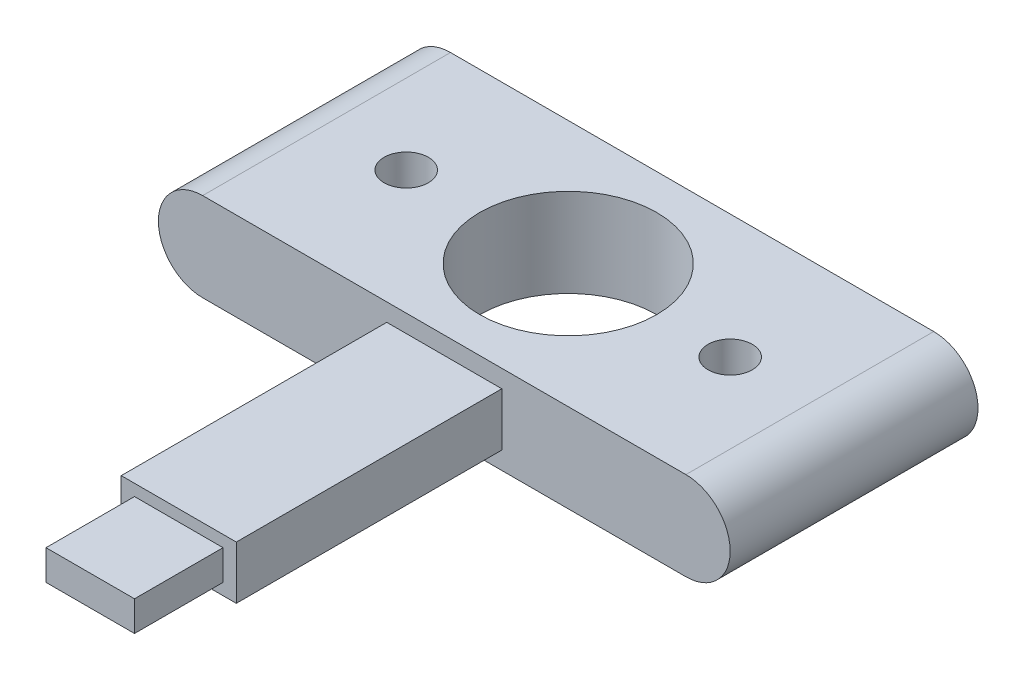
ISO-10303-21;
HEADER;
FILE_DESCRIPTION(('STEP AP214'),'2;1');
FILE_NAME('part.step','',(''),(''),'','','');
FILE_SCHEMA(('AUTOMOTIVE_DESIGN { 1 0 10303 214 1 1 1 1 }'));
ENDSEC;
DATA;
#1=APPLICATION_CONTEXT('core data for automotive mechanical design processes');
#2=APPLICATION_PROTOCOL_DEFINITION('international standard','automotive_design',2000,#1);
#3=PRODUCT_CONTEXT('',#1,'mechanical');
#4=PRODUCT('Part','Part','',(#3));
#5=PRODUCT_RELATED_PRODUCT_CATEGORY('part','',(#4));
#6=PRODUCT_DEFINITION_FORMATION('','',#4);
#7=PRODUCT_DEFINITION_CONTEXT('part definition',#1,'design');
#8=PRODUCT_DEFINITION('design','',#6,#7);
#9=PRODUCT_DEFINITION_SHAPE('','',#8);
#10=(LENGTH_UNIT() NAMED_UNIT(*) SI_UNIT(.MILLI.,.METRE.));
#11=(NAMED_UNIT(*) PLANE_ANGLE_UNIT() SI_UNIT($,.RADIAN.));
#12=(NAMED_UNIT(*) SI_UNIT($,.STERADIAN.) SOLID_ANGLE_UNIT());
#13=UNCERTAINTY_MEASURE_WITH_UNIT(LENGTH_MEASURE(1.E-05),#10,'distance_accuracy_value','');
#14=(GEOMETRIC_REPRESENTATION_CONTEXT(3) GLOBAL_UNCERTAINTY_ASSIGNED_CONTEXT((#13)) GLOBAL_UNIT_ASSIGNED_CONTEXT((#10,
#11,#12)) REPRESENTATION_CONTEXT('',''));
#15=CARTESIAN_POINT('',(0.,0.,0.));
#16=DIRECTION('',(0.,0.,1.));
#17=DIRECTION('',(1.,0.,0.));
#18=AXIS2_PLACEMENT_3D('',#15,#16,#17);
#19=CARTESIAN_POINT('',(32.766,-41.5233681196504,73.66));
#20=DIRECTION('',(0.,0.,1.));
#21=DIRECTION('',(1.,0.,0.));
#22=AXIS2_PLACEMENT_3D('',#19,#20,#21);
#23=PLANE('',#22);
#24=DIRECTION('',(-1.,0.,0.));
#25=VECTOR('',#24,1.);
#26=CARTESIAN_POINT('',(32.766,2.54,73.66));
#27=LINE('',#26,#25);
#28=CARTESIAN_POINT('',(49.276,2.54,73.66));
#29=VERTEX_POINT('',#28);
#30=CARTESIAN_POINT('',(32.766,2.54,73.66));
#31=VERTEX_POINT('',#30);
#32=EDGE_CURVE('E13',#29,#31,#27,.T.);
#33=ORIENTED_EDGE('',*,*,#32,.F.);
#34=DIRECTION('',(0.,1.,0.));
#35=VECTOR('',#34,1.);
#36=CARTESIAN_POINT('',(49.276,-41.5233681196504,73.66));
#37=LINE('',#36,#35);
#38=CARTESIAN_POINT('',(49.276,10.16,73.66));
#39=VERTEX_POINT('',#38);
#40=EDGE_CURVE('E185',#29,#39,#37,.T.);
#41=ORIENTED_EDGE('',*,*,#40,.T.);
#42=DIRECTION('',(1.,0.,0.));
#43=VECTOR('',#42,1.);
#44=CARTESIAN_POINT('',(32.766,10.16,73.66));
#45=LINE('',#44,#43);
#46=CARTESIAN_POINT('',(32.766,10.16,73.66));
#47=VERTEX_POINT('',#46);
#48=EDGE_CURVE('E56',#47,#39,#45,.T.);
#49=ORIENTED_EDGE('',*,*,#48,.F.);
#50=DIRECTION('',(0.,1.,0.));
#51=VECTOR('',#50,1.);
#52=CARTESIAN_POINT('',(32.766,-41.5233681196504,73.66));
#53=LINE('',#52,#51);
#54=EDGE_CURVE('E180',#31,#47,#53,.T.);
#55=ORIENTED_EDGE('',*,*,#54,.F.);
#56=EDGE_LOOP('',(#33,#41,#49,#55));
#57=FACE_BOUND('',#56,.T.);
#58=DIRECTION('',(-1.,0.,0.));
#59=VECTOR('',#58,1.);
#60=CARTESIAN_POINT('',(34.671,8.509,73.66));
#61=LINE('',#60,#59);
#62=CARTESIAN_POINT('',(47.371,8.509,73.66));
#63=VERTEX_POINT('',#62);
#64=CARTESIAN_POINT('',(34.671,8.509,73.66));
#65=VERTEX_POINT('',#64);
#66=EDGE_CURVE('E471',#63,#65,#61,.T.);
#67=ORIENTED_EDGE('',*,*,#66,.F.);
#68=DIRECTION('',(0.,1.,0.));
#69=VECTOR('',#68,1.);
#70=CARTESIAN_POINT('',(47.371,4.191,73.66));
#71=LINE('',#70,#69);
#72=CARTESIAN_POINT('',(47.371,4.191,73.66));
#73=VERTEX_POINT('',#72);
#74=EDGE_CURVE('E160',#73,#63,#71,.T.);
#75=ORIENTED_EDGE('',*,*,#74,.F.);
#76=DIRECTION('',(1.,0.,0.));
#77=VECTOR('',#76,1.);
#78=CARTESIAN_POINT('',(34.671,4.191,73.66));
#79=LINE('',#78,#77);
#80=CARTESIAN_POINT('',(34.671,4.191,73.66));
#81=VERTEX_POINT('',#80);
#82=EDGE_CURVE('E156',#81,#73,#79,.T.);
#83=ORIENTED_EDGE('',*,*,#82,.F.);
#84=DIRECTION('',(0.,-1.,0.));
#85=VECTOR('',#84,1.);
#86=CARTESIAN_POINT('',(34.671,4.191,73.66));
#87=LINE('',#86,#85);
#88=EDGE_CURVE('E473',#65,#81,#87,.T.);
#89=ORIENTED_EDGE('',*,*,#88,.F.);
#90=EDGE_LOOP('',(#67,#75,#83,#89));
#91=FACE_BOUND('',#90,.T.);
#92=ADVANCED_FACE('F46',(#57,#91),#23,.T.);
#93=CARTESIAN_POINT('',(0.,12.7,35.56));
#94=DIRECTION('',(0.,1.,0.));
#95=DIRECTION('',(0.,0.,1.));
#96=AXIS2_PLACEMENT_3D('',#93,#94,#95);
#97=PLANE('',#96);
#98=CARTESIAN_POINT('',(17.78,12.7,17.78));
#99=DIRECTION('',(0.,1.,0.));
#100=DIRECTION('',(0.,0.,-1.));
#101=AXIS2_PLACEMENT_3D('',#98,#99,#100);
#102=CIRCLE('',#101,3.175);
#103=CARTESIAN_POINT('',(17.78,12.7,14.605));
#104=VERTEX_POINT('',#103);
#105=EDGE_CURVE('E452',#104,#104,#102,.T.);
#106=ORIENTED_EDGE('',*,*,#105,.F.);
#107=EDGE_LOOP('',(#106));
#108=FACE_BOUND('',#107,.T.);
#109=CARTESIAN_POINT('',(64.262,12.7,17.78));
#110=DIRECTION('',(0.,1.,0.));
#111=DIRECTION('',(0.,0.,1.));
#112=AXIS2_PLACEMENT_3D('',#109,#110,#111);
#113=CIRCLE('',#112,3.175);
#114=CARTESIAN_POINT('',(64.262,12.7,20.955));
#115=VERTEX_POINT('',#114);
#116=EDGE_CURVE('E451',#115,#115,#113,.T.);
#117=ORIENTED_EDGE('',*,*,#116,.F.);
#118=EDGE_LOOP('',(#117));
#119=FACE_BOUND('',#118,.T.);
#120=CARTESIAN_POINT('',(41.021,12.7,17.78));
#121=DIRECTION('',(0.,1.,0.));
#122=DIRECTION('',(0.,0.,1.));
#123=AXIS2_PLACEMENT_3D('',#120,#121,#122);
#124=CIRCLE('',#123,12.7);
#125=CARTESIAN_POINT('',(41.021,12.7,30.48));
#126=VERTEX_POINT('',#125);
#127=EDGE_CURVE('E461',#126,#126,#124,.T.);
#128=ORIENTED_EDGE('',*,*,#127,.F.);
#129=EDGE_LOOP('',(#128));
#130=FACE_BOUND('',#129,.T.);
#131=DIRECTION('',(1.,0.,0.));
#132=VECTOR('',#131,1.);
#133=CARTESIAN_POINT('',(0.,12.7,35.56));
#134=LINE('',#133,#132);
#135=CARTESIAN_POINT('',(6.34999999999999,12.7,35.56));
#136=VERTEX_POINT('',#135);
#137=CARTESIAN_POINT('',(75.692,12.7,35.56));
#138=VERTEX_POINT('',#137);
#139=EDGE_CURVE('E198',#136,#138,#134,.T.);
#140=ORIENTED_EDGE('',*,*,#139,.T.);
#141=DIRECTION('',(0.,0.,-1.));
#142=VECTOR('',#141,1.);
#143=CARTESIAN_POINT('',(75.692,12.7,35.56));
#144=LINE('',#143,#142);
#145=CARTESIAN_POINT('',(75.692,12.7,0.));
#146=VERTEX_POINT('',#145);
#147=EDGE_CURVE('E205',#138,#146,#144,.T.);
#148=ORIENTED_EDGE('',*,*,#147,.T.);
#149=DIRECTION('',(1.,0.,0.));
#150=VECTOR('',#149,1.);
#151=CARTESIAN_POINT('',(0.,12.7,0.));
#152=LINE('',#151,#150);
#153=CARTESIAN_POINT('',(6.34999999999999,12.7,0.));
#154=VERTEX_POINT('',#153);
#155=EDGE_CURVE('E206',#154,#146,#152,.T.);
#156=ORIENTED_EDGE('',*,*,#155,.F.);
#157=DIRECTION('',(0.,0.,-1.));
#158=VECTOR('',#157,1.);
#159=CARTESIAN_POINT('',(6.34999999999999,12.7,35.56));
#160=LINE('',#159,#158);
#161=EDGE_CURVE('E191',#136,#154,#160,.T.);
#162=ORIENTED_EDGE('',*,*,#161,.F.);
#163=EDGE_LOOP('',(#140,#148,#156,#162));
#164=FACE_BOUND('',#163,.T.);
#165=ADVANCED_FACE('F48',(#108,#119,#130,#164),#97,.T.);
#166=CARTESIAN_POINT('',(6.34999999999999,6.35,35.56));
#167=DIRECTION('',(0.,0.,-1.));
#168=DIRECTION('',(-1.,0.,0.));
#169=AXIS2_PLACEMENT_3D('',#166,#167,#168);
#170=CYLINDRICAL_SURFACE('',#169,6.35);
#171=CARTESIAN_POINT('',(6.34999999999999,6.35,0.));
#172=DIRECTION('',(0.,0.,1.));
#173=DIRECTION('',(1.,0.,0.));
#174=AXIS2_PLACEMENT_3D('',#171,#172,#173);
#175=CIRCLE('',#174,6.35);
#176=CARTESIAN_POINT('',(6.34999999999999,0.,0.));
#177=VERTEX_POINT('',#176);
#178=EDGE_CURVE('E209',#154,#177,#175,.T.);
#179=ORIENTED_EDGE('',*,*,#178,.T.);
#180=DIRECTION('',(0.,0.,-1.));
#181=VECTOR('',#180,1.);
#182=CARTESIAN_POINT('',(6.34999999999999,0.,35.56));
#183=LINE('',#182,#181);
#184=CARTESIAN_POINT('',(6.34999999999999,0.,35.56));
#185=VERTEX_POINT('',#184);
#186=EDGE_CURVE('E220',#185,#177,#183,.T.);
#187=ORIENTED_EDGE('',*,*,#186,.F.);
#188=CARTESIAN_POINT('',(6.34999999999999,6.35,35.56));
#189=DIRECTION('',(0.,0.,1.));
#190=DIRECTION('',(1.,0.,0.));
#191=AXIS2_PLACEMENT_3D('',#188,#189,#190);
#192=CIRCLE('',#191,6.35);
#193=EDGE_CURVE('E197',#136,#185,#192,.T.);
#194=ORIENTED_EDGE('',*,*,#193,.F.);
#195=ORIENTED_EDGE('',*,*,#161,.T.);
#196=EDGE_LOOP('',(#179,#187,#194,#195));
#197=FACE_BOUND('',#196,.T.);
#198=ADVANCED_FACE('F225',(#197),#170,.T.);
#199=CARTESIAN_POINT('',(0.,0.,35.56));
#200=DIRECTION('',(0.,1.,0.));
#201=DIRECTION('',(0.,0.,1.));
#202=AXIS2_PLACEMENT_3D('',#199,#200,#201);
#203=PLANE('',#202);
#204=CARTESIAN_POINT('',(41.021,0.,17.78));
#205=DIRECTION('',(0.,1.,0.));
#206=DIRECTION('',(0.,0.,1.));
#207=AXIS2_PLACEMENT_3D('',#204,#205,#206);
#208=CIRCLE('',#207,12.7);
#209=CARTESIAN_POINT('',(41.021,0.,30.48));
#210=VERTEX_POINT('',#209);
#211=EDGE_CURVE('E463',#210,#210,#208,.T.);
#212=ORIENTED_EDGE('',*,*,#211,.T.);
#213=EDGE_LOOP('',(#212));
#214=FACE_BOUND('',#213,.T.);
#215=DIRECTION('',(0.,0.,-1.));
#216=VECTOR('',#215,1.);
#217=CARTESIAN_POINT('',(75.692,0.,35.56));
#218=LINE('',#217,#216);
#219=CARTESIAN_POINT('',(75.692,0.,35.56));
#220=VERTEX_POINT('',#219);
#221=CARTESIAN_POINT('',(75.692,0.,0.));
#222=VERTEX_POINT('',#221);
#223=EDGE_CURVE('E218',#220,#222,#218,.T.);
#224=ORIENTED_EDGE('',*,*,#223,.F.);
#225=DIRECTION('',(1.,0.,0.));
#226=VECTOR('',#225,1.);
#227=CARTESIAN_POINT('',(0.,0.,35.56));
#228=LINE('',#227,#226);
#229=EDGE_CURVE('E192',#185,#220,#228,.T.);
#230=ORIENTED_EDGE('',*,*,#229,.F.);
#231=ORIENTED_EDGE('',*,*,#186,.T.);
#232=DIRECTION('',(1.,0.,0.));
#233=VECTOR('',#232,1.);
#234=CARTESIAN_POINT('',(0.,0.,0.));
#235=LINE('',#234,#233);
#236=EDGE_CURVE('E211',#177,#222,#235,.T.);
#237=ORIENTED_EDGE('',*,*,#236,.T.);
#238=EDGE_LOOP('',(#224,#230,#231,#237));
#239=FACE_BOUND('',#238,.T.);
#240=ADVANCED_FACE('F243',(#214,#239),#203,.F.);
#241=CARTESIAN_POINT('',(75.692,6.35,35.56));
#242=DIRECTION('',(0.,0.,-1.));
#243=DIRECTION('',(-1.,0.,0.));
#244=AXIS2_PLACEMENT_3D('',#241,#242,#243);
#245=CYLINDRICAL_SURFACE('',#244,6.35);
#246=CARTESIAN_POINT('',(75.692,6.35,0.));
#247=DIRECTION('',(0.,0.,1.));
#248=DIRECTION('',(1.,0.,0.));
#249=AXIS2_PLACEMENT_3D('',#246,#247,#248);
#250=CIRCLE('',#249,6.35);
#251=EDGE_CURVE('E214',#146,#222,#250,.F.);
#252=ORIENTED_EDGE('',*,*,#251,.F.);
#253=ORIENTED_EDGE('',*,*,#147,.F.);
#254=CARTESIAN_POINT('',(75.692,6.35,35.56));
#255=DIRECTION('',(0.,0.,1.));
#256=DIRECTION('',(1.,0.,0.));
#257=AXIS2_PLACEMENT_3D('',#254,#255,#256);
#258=CIRCLE('',#257,6.35);
#259=EDGE_CURVE('E196',#138,#220,#258,.F.);
#260=ORIENTED_EDGE('',*,*,#259,.T.);
#261=ORIENTED_EDGE('',*,*,#223,.T.);
#262=EDGE_LOOP('',(#252,#253,#260,#261));
#263=FACE_BOUND('',#262,.T.);
#264=ADVANCED_FACE('F237',(#263),#245,.T.);
#265=CARTESIAN_POINT('',(0.,0.,35.56));
#266=DIRECTION('',(0.,0.,1.));
#267=DIRECTION('',(1.,0.,0.));
#268=AXIS2_PLACEMENT_3D('',#265,#266,#267);
#269=PLANE('',#268);
#270=DIRECTION('',(0.,1.,0.));
#271=VECTOR('',#270,1.);
#272=CARTESIAN_POINT('',(49.276,-41.5233681196504,35.56));
#273=LINE('',#272,#271);
#274=CARTESIAN_POINT('',(49.276,2.54,35.56));
#275=VERTEX_POINT('',#274);
#276=CARTESIAN_POINT('',(49.276,10.16,35.56));
#277=VERTEX_POINT('',#276);
#278=EDGE_CURVE('E187',#275,#277,#273,.T.);
#279=ORIENTED_EDGE('',*,*,#278,.F.);
#280=DIRECTION('',(-1.,0.,0.));
#281=VECTOR('',#280,1.);
#282=CARTESIAN_POINT('',(82.042,2.54,35.56));
#283=LINE('',#282,#281);
#284=CARTESIAN_POINT('',(32.766,2.54,35.56));
#285=VERTEX_POINT('',#284);
#286=EDGE_CURVE('E165',#275,#285,#283,.T.);
#287=ORIENTED_EDGE('',*,*,#286,.T.);
#288=DIRECTION('',(0.,1.,0.));
#289=VECTOR('',#288,1.);
#290=CARTESIAN_POINT('',(32.766,-41.5233681196504,35.56));
#291=LINE('',#290,#289);
#292=CARTESIAN_POINT('',(32.766,10.16,35.56));
#293=VERTEX_POINT('',#292);
#294=EDGE_CURVE('E50',#285,#293,#291,.T.);
#295=ORIENTED_EDGE('',*,*,#294,.T.);
#296=DIRECTION('',(-1.,0.,0.));
#297=VECTOR('',#296,1.);
#298=CARTESIAN_POINT('',(82.042,10.16,35.56));
#299=LINE('',#298,#297);
#300=EDGE_CURVE('E175',#277,#293,#299,.T.);
#301=ORIENTED_EDGE('',*,*,#300,.F.);
#302=EDGE_LOOP('',(#279,#287,#295,#301));
#303=FACE_BOUND('',#302,.T.);
#304=ORIENTED_EDGE('',*,*,#229,.T.);
#305=ORIENTED_EDGE('',*,*,#259,.F.);
#306=ORIENTED_EDGE('',*,*,#139,.F.);
#307=ORIENTED_EDGE('',*,*,#193,.T.);
#308=EDGE_LOOP('',(#304,#305,#306,#307));
#309=FACE_BOUND('',#308,.T.);
#310=ADVANCED_FACE('F239',(#303,#309),#269,.T.);
#311=CARTESIAN_POINT('',(0.,0.,0.));
#312=DIRECTION('',(0.,0.,1.));
#313=DIRECTION('',(1.,0.,0.));
#314=AXIS2_PLACEMENT_3D('',#311,#312,#313);
#315=PLANE('',#314);
#316=ORIENTED_EDGE('',*,*,#155,.T.);
#317=ORIENTED_EDGE('',*,*,#251,.T.);
#318=ORIENTED_EDGE('',*,*,#236,.F.);
#319=ORIENTED_EDGE('',*,*,#178,.F.);
#320=EDGE_LOOP('',(#316,#317,#318,#319));
#321=FACE_BOUND('',#320,.T.);
#322=ADVANCED_FACE('F232',(#321),#315,.F.);
#323=CARTESIAN_POINT('',(32.766,-41.5233681196504,35.56));
#324=DIRECTION('',(-1.,0.,0.));
#325=DIRECTION('',(0.,0.,1.));
#326=AXIS2_PLACEMENT_3D('',#323,#324,#325);
#327=PLANE('',#326);
#328=DIRECTION('',(0.,0.,-1.));
#329=VECTOR('',#328,1.);
#330=CARTESIAN_POINT('',(32.766,2.54,35.56));
#331=LINE('',#330,#329);
#332=EDGE_CURVE('E162',#31,#285,#331,.T.);
#333=ORIENTED_EDGE('',*,*,#332,.F.);
#334=ORIENTED_EDGE('',*,*,#54,.T.);
#335=DIRECTION('',(0.,0.,1.));
#336=VECTOR('',#335,1.);
#337=CARTESIAN_POINT('',(32.766,10.16,35.56));
#338=LINE('',#337,#336);
#339=EDGE_CURVE('E172',#293,#47,#338,.T.);
#340=ORIENTED_EDGE('',*,*,#339,.F.);
#341=ORIENTED_EDGE('',*,*,#294,.F.);
#342=EDGE_LOOP('',(#333,#334,#340,#341));
#343=FACE_BOUND('',#342,.T.);
#344=ADVANCED_FACE('F265',(#343),#327,.T.);
#345=CARTESIAN_POINT('',(49.276,-41.5233681196504,35.56));
#346=DIRECTION('',(1.,0.,0.));
#347=DIRECTION('',(0.,0.,-1.));
#348=AXIS2_PLACEMENT_3D('',#345,#346,#347);
#349=PLANE('',#348);
#350=DIRECTION('',(0.,0.,1.));
#351=VECTOR('',#350,1.);
#352=CARTESIAN_POINT('',(49.276,2.54,35.56));
#353=LINE('',#352,#351);
#354=EDGE_CURVE('E71',#275,#29,#353,.T.);
#355=ORIENTED_EDGE('',*,*,#354,.F.);
#356=ORIENTED_EDGE('',*,*,#278,.T.);
#357=DIRECTION('',(0.,0.,-1.));
#358=VECTOR('',#357,1.);
#359=CARTESIAN_POINT('',(49.276,10.16,35.56));
#360=LINE('',#359,#358);
#361=EDGE_CURVE('E178',#39,#277,#360,.T.);
#362=ORIENTED_EDGE('',*,*,#361,.F.);
#363=ORIENTED_EDGE('',*,*,#40,.F.);
#364=EDGE_LOOP('',(#355,#356,#362,#363));
#365=FACE_BOUND('',#364,.T.);
#366=ADVANCED_FACE('F263',(#365),#349,.T.);
#367=CARTESIAN_POINT('',(82.042,10.16,35.56));
#368=DIRECTION('',(0.,-1.,0.));
#369=DIRECTION('',(0.,0.,-1.));
#370=AXIS2_PLACEMENT_3D('',#367,#368,#369);
#371=PLANE('',#370);
#372=ORIENTED_EDGE('',*,*,#361,.T.);
#373=ORIENTED_EDGE('',*,*,#300,.T.);
#374=ORIENTED_EDGE('',*,*,#339,.T.);
#375=ORIENTED_EDGE('',*,*,#48,.T.);
#376=EDGE_LOOP('',(#372,#373,#374,#375));
#377=FACE_BOUND('',#376,.T.);
#378=ADVANCED_FACE('F289',(#377),#371,.F.);
#379=CARTESIAN_POINT('',(82.042,2.54,35.56));
#380=DIRECTION('',(0.,1.,0.));
#381=DIRECTION('',(0.,0.,1.));
#382=AXIS2_PLACEMENT_3D('',#379,#380,#381);
#383=PLANE('',#382);
#384=ORIENTED_EDGE('',*,*,#354,.T.);
#385=ORIENTED_EDGE('',*,*,#32,.T.);
#386=ORIENTED_EDGE('',*,*,#332,.T.);
#387=ORIENTED_EDGE('',*,*,#286,.F.);
#388=EDGE_LOOP('',(#384,#385,#386,#387));
#389=FACE_BOUND('',#388,.T.);
#390=ADVANCED_FACE('F296',(#389),#383,.F.);
#391=CARTESIAN_POINT('',(47.371,4.191,86.36));
#392=DIRECTION('',(-1.,0.,0.));
#393=DIRECTION('',(0.,0.,1.));
#394=AXIS2_PLACEMENT_3D('',#391,#392,#393);
#395=PLANE('',#394);
#396=ORIENTED_EDGE('',*,*,#74,.T.);
#397=DIRECTION('',(0.,0.,-1.));
#398=VECTOR('',#397,1.);
#399=CARTESIAN_POINT('',(47.371,8.509,86.36));
#400=LINE('',#399,#398);
#401=CARTESIAN_POINT('',(47.371,8.509,86.36));
#402=VERTEX_POINT('',#401);
#403=EDGE_CURVE('E141',#402,#63,#400,.T.);
#404=ORIENTED_EDGE('',*,*,#403,.F.);
#405=DIRECTION('',(0.,1.,0.));
#406=VECTOR('',#405,1.);
#407=CARTESIAN_POINT('',(47.371,4.191,86.36));
#408=LINE('',#407,#406);
#409=CARTESIAN_POINT('',(47.371,4.191,86.36));
#410=VERTEX_POINT('',#409);
#411=EDGE_CURVE('E148',#410,#402,#408,.T.);
#412=ORIENTED_EDGE('',*,*,#411,.F.);
#413=DIRECTION('',(0.,0.,-1.));
#414=VECTOR('',#413,1.);
#415=CARTESIAN_POINT('',(47.371,4.191,86.36));
#416=LINE('',#415,#414);
#417=EDGE_CURVE('E469',#410,#73,#416,.T.);
#418=ORIENTED_EDGE('',*,*,#417,.T.);
#419=EDGE_LOOP('',(#396,#404,#412,#418));
#420=FACE_BOUND('',#419,.T.);
#421=ADVANCED_FACE('F158',(#420),#395,.F.);
#422=CARTESIAN_POINT('',(34.671,8.509,86.36));
#423=DIRECTION('',(0.,-1.,0.));
#424=DIRECTION('',(0.,0.,-1.));
#425=AXIS2_PLACEMENT_3D('',#422,#423,#424);
#426=PLANE('',#425);
#427=ORIENTED_EDGE('',*,*,#66,.T.);
#428=DIRECTION('',(0.,0.,-1.));
#429=VECTOR('',#428,1.);
#430=CARTESIAN_POINT('',(34.671,8.509,86.36));
#431=LINE('',#430,#429);
#432=CARTESIAN_POINT('',(34.671,8.509,86.36));
#433=VERTEX_POINT('',#432);
#434=EDGE_CURVE('E144',#433,#65,#431,.T.);
#435=ORIENTED_EDGE('',*,*,#434,.F.);
#436=DIRECTION('',(-1.,0.,0.));
#437=VECTOR('',#436,1.);
#438=CARTESIAN_POINT('',(34.671,8.509,86.36));
#439=LINE('',#438,#437);
#440=EDGE_CURVE('E137',#402,#433,#439,.T.);
#441=ORIENTED_EDGE('',*,*,#440,.F.);
#442=ORIENTED_EDGE('',*,*,#403,.T.);
#443=EDGE_LOOP('',(#427,#435,#441,#442));
#444=FACE_BOUND('',#443,.T.);
#445=ADVANCED_FACE('F139',(#444),#426,.F.);
#446=CARTESIAN_POINT('',(34.671,4.191,86.36));
#447=DIRECTION('',(1.,0.,0.));
#448=DIRECTION('',(0.,0.,-1.));
#449=AXIS2_PLACEMENT_3D('',#446,#447,#448);
#450=PLANE('',#449);
#451=ORIENTED_EDGE('',*,*,#88,.T.);
#452=DIRECTION('',(0.,0.,-1.));
#453=VECTOR('',#452,1.);
#454=CARTESIAN_POINT('',(34.671,4.191,86.36));
#455=LINE('',#454,#453);
#456=CARTESIAN_POINT('',(34.671,4.191,86.36));
#457=VERTEX_POINT('',#456);
#458=EDGE_CURVE('E64',#457,#81,#455,.T.);
#459=ORIENTED_EDGE('',*,*,#458,.F.);
#460=DIRECTION('',(0.,-1.,0.));
#461=VECTOR('',#460,1.);
#462=CARTESIAN_POINT('',(34.671,4.191,86.36));
#463=LINE('',#462,#461);
#464=EDGE_CURVE('E147',#433,#457,#463,.T.);
#465=ORIENTED_EDGE('',*,*,#464,.F.);
#466=ORIENTED_EDGE('',*,*,#434,.T.);
#467=EDGE_LOOP('',(#451,#459,#465,#466));
#468=FACE_BOUND('',#467,.T.);
#469=ADVANCED_FACE('F315',(#468),#450,.F.);
#470=CARTESIAN_POINT('',(34.671,4.191,86.36));
#471=DIRECTION('',(0.,1.,0.));
#472=DIRECTION('',(0.,0.,1.));
#473=AXIS2_PLACEMENT_3D('',#470,#471,#472);
#474=PLANE('',#473);
#475=ORIENTED_EDGE('',*,*,#82,.T.);
#476=ORIENTED_EDGE('',*,*,#417,.F.);
#477=DIRECTION('',(1.,0.,0.));
#478=VECTOR('',#477,1.);
#479=CARTESIAN_POINT('',(34.671,4.191,86.36));
#480=LINE('',#479,#478);
#481=EDGE_CURVE('E152',#457,#410,#480,.T.);
#482=ORIENTED_EDGE('',*,*,#481,.F.);
#483=ORIENTED_EDGE('',*,*,#458,.T.);
#484=EDGE_LOOP('',(#475,#476,#482,#483));
#485=FACE_BOUND('',#484,.T.);
#486=ADVANCED_FACE('F322',(#485),#474,.F.);
#487=CARTESIAN_POINT('',(0.,0.,86.36));
#488=DIRECTION('',(0.,0.,-1.));
#489=DIRECTION('',(-1.,0.,0.));
#490=AXIS2_PLACEMENT_3D('',#487,#488,#489);
#491=PLANE('',#490);
#492=ORIENTED_EDGE('',*,*,#411,.T.);
#493=ORIENTED_EDGE('',*,*,#440,.T.);
#494=ORIENTED_EDGE('',*,*,#464,.T.);
#495=ORIENTED_EDGE('',*,*,#481,.T.);
#496=EDGE_LOOP('',(#492,#493,#494,#495));
#497=FACE_BOUND('',#496,.T.);
#498=ADVANCED_FACE('F151',(#497),#491,.F.);
#499=CARTESIAN_POINT('',(41.021,0.,17.78));
#500=DIRECTION('',(0.,1.,0.));
#501=DIRECTION('',(0.,0.,1.));
#502=AXIS2_PLACEMENT_3D('',#499,#500,#501);
#503=CYLINDRICAL_SURFACE('',#502,12.7);
#504=ORIENTED_EDGE('',*,*,#211,.F.);
#505=EDGE_LOOP('',(#504));
#506=FACE_BOUND('',#505,.T.);
#507=ORIENTED_EDGE('',*,*,#127,.T.);
#508=EDGE_LOOP('',(#507));
#509=FACE_BOUND('',#508,.T.);
#510=ADVANCED_FACE('F336',(#506,#509),#503,.F.);
#511=CARTESIAN_POINT('',(64.262,7.62000000000001,17.78));
#512=DIRECTION('',(0.,1.,0.));
#513=DIRECTION('',(0.,0.,1.));
#514=AXIS2_PLACEMENT_3D('',#511,#512,#513);
#515=CYLINDRICAL_SURFACE('',#514,3.175);
#516=CARTESIAN_POINT('',(64.262,7.62000000000001,17.78));
#517=DIRECTION('',(0.,1.,0.));
#518=DIRECTION('',(0.,0.,1.));
#519=AXIS2_PLACEMENT_3D('',#516,#517,#518);
#520=CIRCLE('',#519,3.175);
#521=CARTESIAN_POINT('',(64.262,7.62000000000001,20.955));
#522=VERTEX_POINT('',#521);
#523=EDGE_CURVE('E455',#522,#522,#520,.T.);
#524=ORIENTED_EDGE('',*,*,#523,.F.);
#525=EDGE_LOOP('',(#524));
#526=FACE_BOUND('',#525,.T.);
#527=ORIENTED_EDGE('',*,*,#116,.T.);
#528=EDGE_LOOP('',(#527));
#529=FACE_BOUND('',#528,.T.);
#530=ADVANCED_FACE('F343',(#526,#529),#515,.F.);
#531=CARTESIAN_POINT('',(64.262,7.62000000000001,17.78));
#532=DIRECTION('',(0.,1.,0.));
#533=DIRECTION('',(0.,0.,1.));
#534=AXIS2_PLACEMENT_3D('',#531,#532,#533);
#535=PLANE('',#534);
#536=ORIENTED_EDGE('',*,*,#523,.T.);
#537=EDGE_LOOP('',(#536));
#538=FACE_BOUND('',#537,.T.);
#539=ADVANCED_FACE('F352',(#538),#535,.T.);
#540=CARTESIAN_POINT('',(17.78,7.62000000000001,17.78));
#541=DIRECTION('',(0.,1.,0.));
#542=DIRECTION('',(0.,0.,1.));
#543=AXIS2_PLACEMENT_3D('',#540,#541,#542);
#544=CYLINDRICAL_SURFACE('',#543,3.175);
#545=CARTESIAN_POINT('',(17.78,7.62000000000001,17.78));
#546=DIRECTION('',(0.,1.,0.));
#547=DIRECTION('',(0.,0.,-1.));
#548=AXIS2_PLACEMENT_3D('',#545,#546,#547);
#549=CIRCLE('',#548,3.175);
#550=CARTESIAN_POINT('',(17.78,7.62000000000001,14.605));
#551=VERTEX_POINT('',#550);
#552=EDGE_CURVE('E450',#551,#551,#549,.T.);
#553=ORIENTED_EDGE('',*,*,#552,.F.);
#554=EDGE_LOOP('',(#553));
#555=FACE_BOUND('',#554,.T.);
#556=ORIENTED_EDGE('',*,*,#105,.T.);
#557=EDGE_LOOP('',(#556));
#558=FACE_BOUND('',#557,.T.);
#559=ADVANCED_FACE('F360',(#555,#558),#544,.F.);
#560=CARTESIAN_POINT('',(17.78,7.62000000000001,17.78));
#561=DIRECTION('',(0.,-1.,0.));
#562=DIRECTION('',(0.,0.,-1.));
#563=AXIS2_PLACEMENT_3D('',#560,#561,#562);
#564=PLANE('',#563);
#565=ORIENTED_EDGE('',*,*,#552,.T.);
#566=EDGE_LOOP('',(#565));
#567=FACE_BOUND('',#566,.T.);
#568=ADVANCED_FACE('F368',(#567),#564,.F.);
#569=CLOSED_SHELL('',(#92,#165,#198,#240,#264,#310,#322,#344,#366,#378,#390,#421,#445,#469,#486,
#498,#510,#530,#539,#559,#568));
#570=MANIFOLD_SOLID_BREP('B2',#569);
#571=ADVANCED_BREP_SHAPE_REPRESENTATION('',(#18,#570),#14);
#572=SHAPE_DEFINITION_REPRESENTATION(#9,#571);
ENDSEC;
END-ISO-10303-21;
